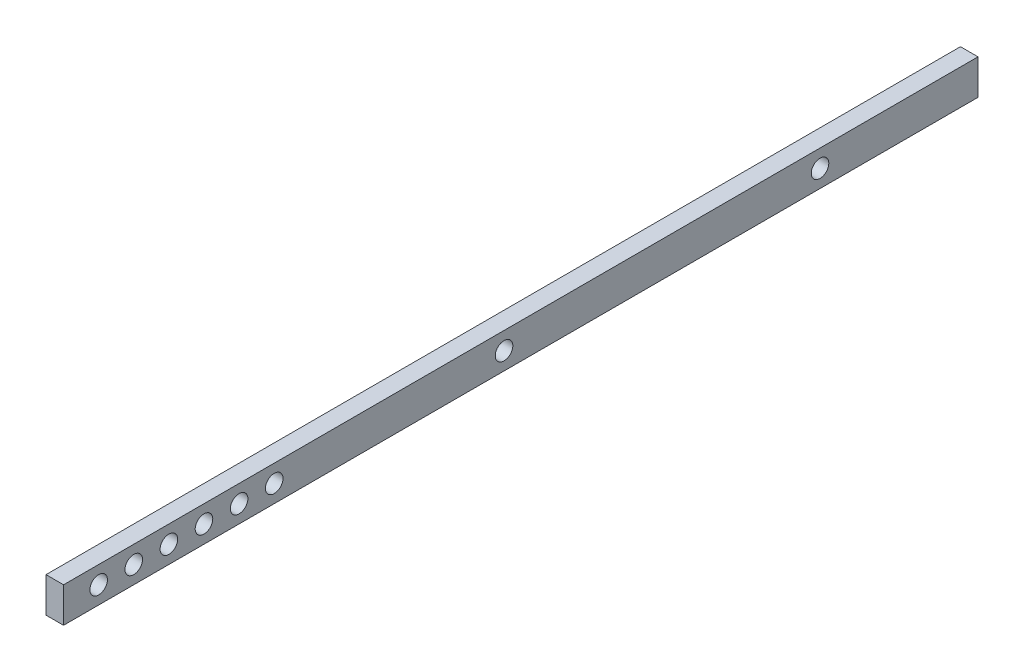
ISO-10303-21;
HEADER;
FILE_DESCRIPTION(('STEP AP214'),'2;1');
FILE_NAME('part.step','',(''),(''),'','','');
FILE_SCHEMA(('AUTOMOTIVE_DESIGN { 1 0 10303 214 1 1 1 1 }'));
ENDSEC;
DATA;
#1=APPLICATION_CONTEXT('core data for automotive mechanical design processes');
#2=APPLICATION_PROTOCOL_DEFINITION('international standard','automotive_design',2000,#1);
#3=PRODUCT_CONTEXT('',#1,'mechanical');
#4=PRODUCT('Part','Part','',(#3));
#5=PRODUCT_RELATED_PRODUCT_CATEGORY('part','',(#4));
#6=PRODUCT_DEFINITION_FORMATION('','',#4);
#7=PRODUCT_DEFINITION_CONTEXT('part definition',#1,'design');
#8=PRODUCT_DEFINITION('design','',#6,#7);
#9=PRODUCT_DEFINITION_SHAPE('','',#8);
#10=(LENGTH_UNIT() NAMED_UNIT(*) SI_UNIT(.MILLI.,.METRE.));
#11=(NAMED_UNIT(*) PLANE_ANGLE_UNIT() SI_UNIT($,.RADIAN.));
#12=(NAMED_UNIT(*) SI_UNIT($,.STERADIAN.) SOLID_ANGLE_UNIT());
#13=UNCERTAINTY_MEASURE_WITH_UNIT(LENGTH_MEASURE(1.E-05),#10,'distance_accuracy_value','');
#14=(GEOMETRIC_REPRESENTATION_CONTEXT(3) GLOBAL_UNCERTAINTY_ASSIGNED_CONTEXT((#13)) GLOBAL_UNIT_ASSIGNED_CONTEXT((#10,
#11,#12)) REPRESENTATION_CONTEXT('',''));
#15=CARTESIAN_POINT('',(0.,0.,0.));
#16=DIRECTION('',(0.,0.,1.));
#17=DIRECTION('',(1.,0.,0.));
#18=AXIS2_PLACEMENT_3D('',#15,#16,#17);
#19=CARTESIAN_POINT('',(3.175,6.34999999999999,0.));
#20=DIRECTION('',(0.,-1.,0.));
#21=DIRECTION('',(0.,0.,-1.));
#22=AXIS2_PLACEMENT_3D('',#19,#20,#21);
#23=PLANE('',#22);
#24=DIRECTION('',(0.,0.,1.));
#25=VECTOR('',#24,1.);
#26=CARTESIAN_POINT('',(0.,6.34999999999999,0.));
#27=LINE('',#26,#25);
#28=CARTESIAN_POINT('',(0.,6.34999999999999,-88.9));
#29=VERTEX_POINT('',#28);
#30=CARTESIAN_POINT('',(0.,6.35000000000001,76.495));
#31=VERTEX_POINT('',#30);
#32=EDGE_CURVE('E90',#29,#31,#27,.T.);
#33=ORIENTED_EDGE('',*,*,#32,.T.);
#34=DIRECTION('',(-1.,0.,0.));
#35=VECTOR('',#34,1.);
#36=CARTESIAN_POINT('',(3.175,6.35000000000001,76.495));
#37=LINE('',#36,#35);
#38=CARTESIAN_POINT('',(3.175,6.35000000000001,76.495));
#39=VERTEX_POINT('',#38);
#40=EDGE_CURVE('E11',#39,#31,#37,.T.);
#41=ORIENTED_EDGE('',*,*,#40,.F.);
#42=DIRECTION('',(0.,0.,1.));
#43=VECTOR('',#42,1.);
#44=CARTESIAN_POINT('',(3.175,6.34999999999999,0.));
#45=LINE('',#44,#43);
#46=CARTESIAN_POINT('',(3.175,6.34999999999999,-88.9));
#47=VERTEX_POINT('',#46);
#48=EDGE_CURVE('E105',#47,#39,#45,.T.);
#49=ORIENTED_EDGE('',*,*,#48,.F.);
#50=DIRECTION('',(-1.,0.,0.));
#51=VECTOR('',#50,1.);
#52=CARTESIAN_POINT('',(3.175,6.34999999999999,-88.9));
#53=LINE('',#52,#51);
#54=EDGE_CURVE('E104',#47,#29,#53,.T.);
#55=ORIENTED_EDGE('',*,*,#54,.T.);
#56=EDGE_LOOP('',(#33,#41,#49,#55));
#57=FACE_BOUND('',#56,.T.);
#58=ADVANCED_FACE('F45',(#57),#23,.F.);
#59=CARTESIAN_POINT('',(3.175,0.,76.495));
#60=DIRECTION('',(0.,0.,-1.));
#61=DIRECTION('',(-1.,0.,0.));
#62=AXIS2_PLACEMENT_3D('',#59,#60,#61);
#63=PLANE('',#62);
#64=DIRECTION('',(0.,-1.,0.));
#65=VECTOR('',#64,1.);
#66=CARTESIAN_POINT('',(0.,0.,76.495));
#67=LINE('',#66,#65);
#68=CARTESIAN_POINT('',(0.,0.,76.495));
#69=VERTEX_POINT('',#68);
#70=EDGE_CURVE('E97',#31,#69,#67,.T.);
#71=ORIENTED_EDGE('',*,*,#70,.T.);
#72=DIRECTION('',(-1.,0.,0.));
#73=VECTOR('',#72,1.);
#74=CARTESIAN_POINT('',(3.175,0.,76.495));
#75=LINE('',#74,#73);
#76=CARTESIAN_POINT('',(3.175,0.,76.495));
#77=VERTEX_POINT('',#76);
#78=EDGE_CURVE('E56',#77,#69,#75,.T.);
#79=ORIENTED_EDGE('',*,*,#78,.F.);
#80=DIRECTION('',(0.,-1.,0.));
#81=VECTOR('',#80,1.);
#82=CARTESIAN_POINT('',(3.175,0.,76.495));
#83=LINE('',#82,#81);
#84=EDGE_CURVE('E65',#39,#77,#83,.T.);
#85=ORIENTED_EDGE('',*,*,#84,.F.);
#86=ORIENTED_EDGE('',*,*,#40,.T.);
#87=EDGE_LOOP('',(#71,#79,#85,#86));
#88=FACE_BOUND('',#87,.T.);
#89=ADVANCED_FACE('F237',(#88),#63,.F.);
#90=CARTESIAN_POINT('',(3.175,0.,0.));
#91=DIRECTION('',(0.,-1.,0.));
#92=DIRECTION('',(0.,0.,-1.));
#93=AXIS2_PLACEMENT_3D('',#90,#91,#92);
#94=PLANE('',#93);
#95=DIRECTION('',(0.,0.,1.));
#96=VECTOR('',#95,1.);
#97=CARTESIAN_POINT('',(0.,0.,0.));
#98=LINE('',#97,#96);
#99=CARTESIAN_POINT('',(0.,0.,-88.9));
#100=VERTEX_POINT('',#99);
#101=EDGE_CURVE('E84',#100,#69,#98,.T.);
#102=ORIENTED_EDGE('',*,*,#101,.F.);
#103=DIRECTION('',(-1.,0.,0.));
#104=VECTOR('',#103,1.);
#105=CARTESIAN_POINT('',(3.175,0.,-88.9));
#106=LINE('',#105,#104);
#107=CARTESIAN_POINT('',(3.175,0.,-88.9));
#108=VERTEX_POINT('',#107);
#109=EDGE_CURVE('E49',#108,#100,#106,.T.);
#110=ORIENTED_EDGE('',*,*,#109,.F.);
#111=DIRECTION('',(0.,0.,1.));
#112=VECTOR('',#111,1.);
#113=CARTESIAN_POINT('',(3.175,0.,0.));
#114=LINE('',#113,#112);
#115=EDGE_CURVE('E162',#108,#77,#114,.T.);
#116=ORIENTED_EDGE('',*,*,#115,.T.);
#117=ORIENTED_EDGE('',*,*,#78,.T.);
#118=EDGE_LOOP('',(#102,#110,#116,#117));
#119=FACE_BOUND('',#118,.T.);
#120=ADVANCED_FACE('F233',(#119),#94,.T.);
#121=CARTESIAN_POINT('',(3.175,3.175,-3.175));
#122=DIRECTION('',(-1.,0.,0.));
#123=DIRECTION('',(0.,0.,1.));
#124=AXIS2_PLACEMENT_3D('',#121,#122,#123);
#125=CYLINDRICAL_SURFACE('',#124,1.5875);
#126=CARTESIAN_POINT('',(3.175,3.175,-3.175));
#127=DIRECTION('',(1.,0.,0.));
#128=DIRECTION('',(0.,0.,-1.));
#129=AXIS2_PLACEMENT_3D('',#126,#127,#128);
#130=CIRCLE('',#129,1.5875);
#131=CARTESIAN_POINT('',(3.175,3.175,-4.7625));
#132=VERTEX_POINT('',#131);
#133=EDGE_CURVE('E158',#132,#132,#130,.T.);
#134=ORIENTED_EDGE('',*,*,#133,.T.);
#135=EDGE_LOOP('',(#134));
#136=FACE_BOUND('',#135,.T.);
#137=CARTESIAN_POINT('',(0.,3.175,-3.175));
#138=DIRECTION('',(1.,0.,0.));
#139=DIRECTION('',(0.,0.,-1.));
#140=AXIS2_PLACEMENT_3D('',#137,#138,#139);
#141=CIRCLE('',#140,1.5875);
#142=CARTESIAN_POINT('',(0.,3.175,-4.7625));
#143=VERTEX_POINT('',#142);
#144=EDGE_CURVE('E124',#143,#143,#141,.T.);
#145=ORIENTED_EDGE('',*,*,#144,.F.);
#146=EDGE_LOOP('',(#145));
#147=FACE_BOUND('',#146,.T.);
#148=ADVANCED_FACE('F229',(#136,#147),#125,.F.);
#149=CARTESIAN_POINT('',(3.175,3.175,38.395));
#150=DIRECTION('',(-1.,0.,0.));
#151=DIRECTION('',(0.,0.,1.));
#152=AXIS2_PLACEMENT_3D('',#149,#150,#151);
#153=CYLINDRICAL_SURFACE('',#152,1.5875);
#154=CARTESIAN_POINT('',(3.175,3.175,38.395));
#155=DIRECTION('',(1.,0.,0.));
#156=DIRECTION('',(0.,0.,-1.));
#157=AXIS2_PLACEMENT_3D('',#154,#155,#156);
#158=CIRCLE('',#157,1.5875);
#159=CARTESIAN_POINT('',(3.175,3.175,36.8075));
#160=VERTEX_POINT('',#159);
#161=EDGE_CURVE('E170',#160,#160,#158,.T.);
#162=ORIENTED_EDGE('',*,*,#161,.T.);
#163=EDGE_LOOP('',(#162));
#164=FACE_BOUND('',#163,.T.);
#165=CARTESIAN_POINT('',(0.,3.175,38.395));
#166=DIRECTION('',(1.,0.,0.));
#167=DIRECTION('',(0.,0.,-1.));
#168=AXIS2_PLACEMENT_3D('',#165,#166,#167);
#169=CIRCLE('',#168,1.5875);
#170=CARTESIAN_POINT('',(0.,3.175,36.8075));
#171=VERTEX_POINT('',#170);
#172=EDGE_CURVE('E101',#171,#171,#169,.T.);
#173=ORIENTED_EDGE('',*,*,#172,.F.);
#174=EDGE_LOOP('',(#173));
#175=FACE_BOUND('',#174,.T.);
#176=ADVANCED_FACE('F232',(#164,#175),#153,.F.);
#177=CARTESIAN_POINT('',(3.175,3.175,44.745));
#178=DIRECTION('',(-1.,0.,0.));
#179=DIRECTION('',(0.,0.,1.));
#180=AXIS2_PLACEMENT_3D('',#177,#178,#179);
#181=CYLINDRICAL_SURFACE('',#180,1.5875);
#182=CARTESIAN_POINT('',(3.175,3.175,44.745));
#183=DIRECTION('',(1.,0.,0.));
#184=DIRECTION('',(0.,0.,-1.));
#185=AXIS2_PLACEMENT_3D('',#182,#183,#184);
#186=CIRCLE('',#185,1.5875);
#187=CARTESIAN_POINT('',(3.175,3.175,43.1575));
#188=VERTEX_POINT('',#187);
#189=EDGE_CURVE('E174',#188,#188,#186,.T.);
#190=ORIENTED_EDGE('',*,*,#189,.T.);
#191=EDGE_LOOP('',(#190));
#192=FACE_BOUND('',#191,.T.);
#193=CARTESIAN_POINT('',(0.,3.175,44.745));
#194=DIRECTION('',(1.,0.,0.));
#195=DIRECTION('',(0.,0.,-1.));
#196=AXIS2_PLACEMENT_3D('',#193,#194,#195);
#197=CIRCLE('',#196,1.5875);
#198=CARTESIAN_POINT('',(0.,3.175,43.1575));
#199=VERTEX_POINT('',#198);
#200=EDGE_CURVE('E135',#199,#199,#197,.T.);
#201=ORIENTED_EDGE('',*,*,#200,.F.);
#202=EDGE_LOOP('',(#201));
#203=FACE_BOUND('',#202,.T.);
#204=ADVANCED_FACE('F245',(#192,#203),#181,.F.);
#205=CARTESIAN_POINT('',(3.175,3.175,51.095));
#206=DIRECTION('',(-1.,0.,0.));
#207=DIRECTION('',(0.,0.,1.));
#208=AXIS2_PLACEMENT_3D('',#205,#206,#207);
#209=CYLINDRICAL_SURFACE('',#208,1.5875);
#210=CARTESIAN_POINT('',(3.175,3.175,51.095));
#211=DIRECTION('',(1.,0.,0.));
#212=DIRECTION('',(0.,0.,-1.));
#213=AXIS2_PLACEMENT_3D('',#210,#211,#212);
#214=CIRCLE('',#213,1.5875);
#215=CARTESIAN_POINT('',(3.175,3.175,49.5075));
#216=VERTEX_POINT('',#215);
#217=EDGE_CURVE('E178',#216,#216,#214,.T.);
#218=ORIENTED_EDGE('',*,*,#217,.T.);
#219=EDGE_LOOP('',(#218));
#220=FACE_BOUND('',#219,.T.);
#221=CARTESIAN_POINT('',(0.,3.175,51.095));
#222=DIRECTION('',(1.,0.,0.));
#223=DIRECTION('',(0.,0.,-1.));
#224=AXIS2_PLACEMENT_3D('',#221,#222,#223);
#225=CIRCLE('',#224,1.5875);
#226=CARTESIAN_POINT('',(0.,3.175,49.5075));
#227=VERTEX_POINT('',#226);
#228=EDGE_CURVE('E139',#227,#227,#225,.T.);
#229=ORIENTED_EDGE('',*,*,#228,.F.);
#230=EDGE_LOOP('',(#229));
#231=FACE_BOUND('',#230,.T.);
#232=ADVANCED_FACE('F249',(#220,#231),#209,.F.);
#233=CARTESIAN_POINT('',(3.175,3.175,57.445));
#234=DIRECTION('',(-1.,0.,0.));
#235=DIRECTION('',(0.,0.,1.));
#236=AXIS2_PLACEMENT_3D('',#233,#234,#235);
#237=CYLINDRICAL_SURFACE('',#236,1.5875);
#238=CARTESIAN_POINT('',(3.175,3.175,57.445));
#239=DIRECTION('',(1.,0.,0.));
#240=DIRECTION('',(0.,0.,-1.));
#241=AXIS2_PLACEMENT_3D('',#238,#239,#240);
#242=CIRCLE('',#241,1.5875);
#243=CARTESIAN_POINT('',(3.175,3.175,55.8575));
#244=VERTEX_POINT('',#243);
#245=EDGE_CURVE('E182',#244,#244,#242,.T.);
#246=ORIENTED_EDGE('',*,*,#245,.T.);
#247=EDGE_LOOP('',(#246));
#248=FACE_BOUND('',#247,.T.);
#249=CARTESIAN_POINT('',(0.,3.175,57.445));
#250=DIRECTION('',(1.,0.,0.));
#251=DIRECTION('',(0.,0.,-1.));
#252=AXIS2_PLACEMENT_3D('',#249,#250,#251);
#253=CIRCLE('',#252,1.5875);
#254=CARTESIAN_POINT('',(0.,3.175,55.8575));
#255=VERTEX_POINT('',#254);
#256=EDGE_CURVE('E143',#255,#255,#253,.T.);
#257=ORIENTED_EDGE('',*,*,#256,.F.);
#258=EDGE_LOOP('',(#257));
#259=FACE_BOUND('',#258,.T.);
#260=ADVANCED_FACE('F253',(#248,#259),#237,.F.);
#261=CARTESIAN_POINT('',(3.175,3.175,63.795));
#262=DIRECTION('',(-1.,0.,0.));
#263=DIRECTION('',(0.,0.,1.));
#264=AXIS2_PLACEMENT_3D('',#261,#262,#263);
#265=CYLINDRICAL_SURFACE('',#264,1.58749999999999);
#266=CARTESIAN_POINT('',(3.175,3.175,63.795));
#267=DIRECTION('',(1.,0.,0.));
#268=DIRECTION('',(0.,0.,-1.));
#269=AXIS2_PLACEMENT_3D('',#266,#267,#268);
#270=CIRCLE('',#269,1.58749999999999);
#271=CARTESIAN_POINT('',(3.175,3.175,62.2075));
#272=VERTEX_POINT('',#271);
#273=EDGE_CURVE('E186',#272,#272,#270,.T.);
#274=ORIENTED_EDGE('',*,*,#273,.T.);
#275=EDGE_LOOP('',(#274));
#276=FACE_BOUND('',#275,.T.);
#277=CARTESIAN_POINT('',(0.,3.175,63.795));
#278=DIRECTION('',(1.,0.,0.));
#279=DIRECTION('',(0.,0.,-1.));
#280=AXIS2_PLACEMENT_3D('',#277,#278,#279);
#281=CIRCLE('',#280,1.58749999999999);
#282=CARTESIAN_POINT('',(0.,3.175,62.2075));
#283=VERTEX_POINT('',#282);
#284=EDGE_CURVE('E147',#283,#283,#281,.T.);
#285=ORIENTED_EDGE('',*,*,#284,.F.);
#286=EDGE_LOOP('',(#285));
#287=FACE_BOUND('',#286,.T.);
#288=ADVANCED_FACE('F257',(#276,#287),#265,.F.);
#289=CARTESIAN_POINT('',(3.175,3.175,70.145));
#290=DIRECTION('',(-1.,0.,0.));
#291=DIRECTION('',(0.,0.,1.));
#292=AXIS2_PLACEMENT_3D('',#289,#290,#291);
#293=CYLINDRICAL_SURFACE('',#292,1.5875);
#294=CARTESIAN_POINT('',(3.175,3.175,70.145));
#295=DIRECTION('',(1.,0.,0.));
#296=DIRECTION('',(0.,0.,-1.));
#297=AXIS2_PLACEMENT_3D('',#294,#295,#296);
#298=CIRCLE('',#297,1.5875);
#299=CARTESIAN_POINT('',(3.175,3.175,68.5575));
#300=VERTEX_POINT('',#299);
#301=EDGE_CURVE('E123',#300,#300,#298,.T.);
#302=ORIENTED_EDGE('',*,*,#301,.T.);
#303=EDGE_LOOP('',(#302));
#304=FACE_BOUND('',#303,.T.);
#305=CARTESIAN_POINT('',(0.,3.175,70.145));
#306=DIRECTION('',(1.,0.,0.));
#307=DIRECTION('',(0.,0.,-1.));
#308=AXIS2_PLACEMENT_3D('',#305,#306,#307);
#309=CIRCLE('',#308,1.5875);
#310=CARTESIAN_POINT('',(0.,3.175,68.5575));
#311=VERTEX_POINT('',#310);
#312=EDGE_CURVE('E151',#311,#311,#309,.T.);
#313=ORIENTED_EDGE('',*,*,#312,.F.);
#314=EDGE_LOOP('',(#313));
#315=FACE_BOUND('',#314,.T.);
#316=ADVANCED_FACE('F194',(#304,#315),#293,.F.);
#317=CARTESIAN_POINT('',(3.175,3.175,-60.325));
#318=DIRECTION('',(-1.,0.,0.));
#319=DIRECTION('',(0.,0.,1.));
#320=AXIS2_PLACEMENT_3D('',#317,#318,#319);
#321=CYLINDRICAL_SURFACE('',#320,1.5875);
#322=CARTESIAN_POINT('',(3.175,3.175,-60.325));
#323=DIRECTION('',(1.,0.,0.));
#324=DIRECTION('',(0.,0.,-1.));
#325=AXIS2_PLACEMENT_3D('',#322,#323,#324);
#326=CIRCLE('',#325,1.5875);
#327=CARTESIAN_POINT('',(3.175,3.175,-61.9125));
#328=VERTEX_POINT('',#327);
#329=EDGE_CURVE('E118',#328,#328,#326,.T.);
#330=ORIENTED_EDGE('',*,*,#329,.T.);
#331=EDGE_LOOP('',(#330));
#332=FACE_BOUND('',#331,.T.);
#333=CARTESIAN_POINT('',(0.,3.175,-60.325));
#334=DIRECTION('',(1.,0.,0.));
#335=DIRECTION('',(0.,0.,-1.));
#336=AXIS2_PLACEMENT_3D('',#333,#334,#335);
#337=CIRCLE('',#336,1.5875);
#338=CARTESIAN_POINT('',(0.,3.175,-61.9125));
#339=VERTEX_POINT('',#338);
#340=EDGE_CURVE('E119',#339,#339,#337,.T.);
#341=ORIENTED_EDGE('',*,*,#340,.F.);
#342=EDGE_LOOP('',(#341));
#343=FACE_BOUND('',#342,.T.);
#344=ADVANCED_FACE('F200',(#332,#343),#321,.F.);
#345=CARTESIAN_POINT('',(3.175,0.,0.));
#346=DIRECTION('',(1.,0.,0.));
#347=DIRECTION('',(0.,0.,-1.));
#348=AXIS2_PLACEMENT_3D('',#345,#346,#347);
#349=PLANE('',#348);
#350=ORIENTED_EDGE('',*,*,#301,.F.);
#351=EDGE_LOOP('',(#350));
#352=FACE_BOUND('',#351,.T.);
#353=ORIENTED_EDGE('',*,*,#273,.F.);
#354=EDGE_LOOP('',(#353));
#355=FACE_BOUND('',#354,.T.);
#356=ORIENTED_EDGE('',*,*,#245,.F.);
#357=EDGE_LOOP('',(#356));
#358=FACE_BOUND('',#357,.T.);
#359=ORIENTED_EDGE('',*,*,#217,.F.);
#360=EDGE_LOOP('',(#359));
#361=FACE_BOUND('',#360,.T.);
#362=ORIENTED_EDGE('',*,*,#189,.F.);
#363=EDGE_LOOP('',(#362));
#364=FACE_BOUND('',#363,.T.);
#365=ORIENTED_EDGE('',*,*,#161,.F.);
#366=EDGE_LOOP('',(#365));
#367=FACE_BOUND('',#366,.T.);
#368=ORIENTED_EDGE('',*,*,#48,.T.);
#369=ORIENTED_EDGE('',*,*,#84,.T.);
#370=ORIENTED_EDGE('',*,*,#115,.F.);
#371=DIRECTION('',(0.,-1.,0.));
#372=VECTOR('',#371,1.);
#373=CARTESIAN_POINT('',(3.175,6.34999999999999,-88.9));
#374=LINE('',#373,#372);
#375=EDGE_CURVE('E110',#47,#108,#374,.T.);
#376=ORIENTED_EDGE('',*,*,#375,.F.);
#377=EDGE_LOOP('',(#368,#369,#370,#376));
#378=FACE_BOUND('',#377,.T.);
#379=ORIENTED_EDGE('',*,*,#133,.F.);
#380=EDGE_LOOP('',(#379));
#381=FACE_BOUND('',#380,.T.);
#382=ORIENTED_EDGE('',*,*,#329,.F.);
#383=EDGE_LOOP('',(#382));
#384=FACE_BOUND('',#383,.T.);
#385=ADVANCED_FACE('F197',(#352,#355,#358,#361,#364,#367,#378,#381,#384),#349,.T.);
#386=CARTESIAN_POINT('',(0.,0.,0.));
#387=DIRECTION('',(1.,0.,0.));
#388=DIRECTION('',(0.,0.,-1.));
#389=AXIS2_PLACEMENT_3D('',#386,#387,#388);
#390=PLANE('',#389);
#391=ORIENTED_EDGE('',*,*,#312,.T.);
#392=EDGE_LOOP('',(#391));
#393=FACE_BOUND('',#392,.T.);
#394=ORIENTED_EDGE('',*,*,#284,.T.);
#395=EDGE_LOOP('',(#394));
#396=FACE_BOUND('',#395,.T.);
#397=ORIENTED_EDGE('',*,*,#256,.T.);
#398=EDGE_LOOP('',(#397));
#399=FACE_BOUND('',#398,.T.);
#400=ORIENTED_EDGE('',*,*,#228,.T.);
#401=EDGE_LOOP('',(#400));
#402=FACE_BOUND('',#401,.T.);
#403=ORIENTED_EDGE('',*,*,#200,.T.);
#404=EDGE_LOOP('',(#403));
#405=FACE_BOUND('',#404,.T.);
#406=ORIENTED_EDGE('',*,*,#172,.T.);
#407=EDGE_LOOP('',(#406));
#408=FACE_BOUND('',#407,.T.);
#409=ORIENTED_EDGE('',*,*,#32,.F.);
#410=DIRECTION('',(0.,-1.,0.));
#411=VECTOR('',#410,1.);
#412=CARTESIAN_POINT('',(0.,6.34999999999999,-88.9));
#413=LINE('',#412,#411);
#414=EDGE_CURVE('E95',#29,#100,#413,.T.);
#415=ORIENTED_EDGE('',*,*,#414,.T.);
#416=ORIENTED_EDGE('',*,*,#101,.T.);
#417=ORIENTED_EDGE('',*,*,#70,.F.);
#418=EDGE_LOOP('',(#409,#415,#416,#417));
#419=FACE_BOUND('',#418,.T.);
#420=ORIENTED_EDGE('',*,*,#144,.T.);
#421=EDGE_LOOP('',(#420));
#422=FACE_BOUND('',#421,.T.);
#423=ORIENTED_EDGE('',*,*,#340,.T.);
#424=EDGE_LOOP('',(#423));
#425=FACE_BOUND('',#424,.T.);
#426=ADVANCED_FACE('F92',(#393,#396,#399,#402,#405,#408,#419,#422,#425),#390,.F.);
#427=CARTESIAN_POINT('',(3.175,6.34999999999999,-88.9));
#428=DIRECTION('',(0.,0.,-1.));
#429=DIRECTION('',(-1.,0.,0.));
#430=AXIS2_PLACEMENT_3D('',#427,#428,#429);
#431=PLANE('',#430);
#432=ORIENTED_EDGE('',*,*,#414,.F.);
#433=ORIENTED_EDGE('',*,*,#54,.F.);
#434=ORIENTED_EDGE('',*,*,#375,.T.);
#435=ORIENTED_EDGE('',*,*,#109,.T.);
#436=EDGE_LOOP('',(#432,#433,#434,#435));
#437=FACE_BOUND('',#436,.T.);
#438=ADVANCED_FACE('F47',(#437),#431,.T.);
#439=CLOSED_SHELL('',(#58,#89,#120,#148,#176,#204,#232,#260,#288,#316,#344,#385,#426,#438));
#440=MANIFOLD_SOLID_BREP('B2',#439);
#441=ADVANCED_BREP_SHAPE_REPRESENTATION('',(#18,#440),#14);
#442=SHAPE_DEFINITION_REPRESENTATION(#9,#441);
ENDSEC;
END-ISO-10303-21;
